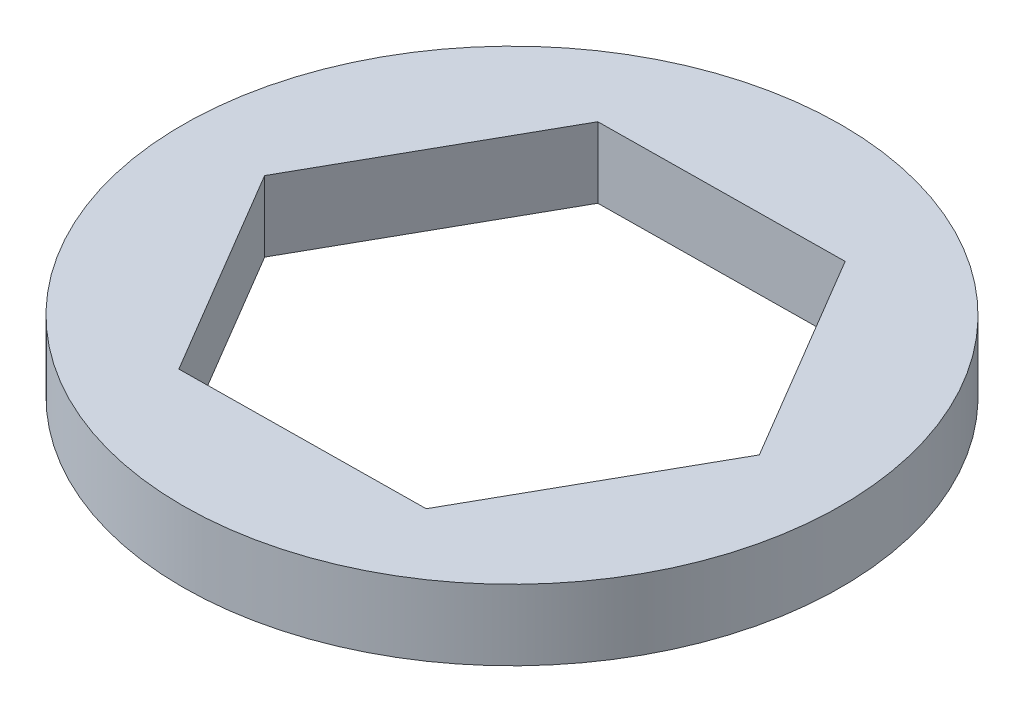
ISO-10303-21;
HEADER;
FILE_DESCRIPTION(('STEP AP214'),'2;1');
FILE_NAME('part.step','',(''),(''),'','','');
FILE_SCHEMA(('AUTOMOTIVE_DESIGN { 1 0 10303 214 1 1 1 1 }'));
ENDSEC;
DATA;
#1=APPLICATION_CONTEXT('core data for automotive mechanical design processes');
#2=APPLICATION_PROTOCOL_DEFINITION('international standard','automotive_design',2000,#1);
#3=PRODUCT_CONTEXT('',#1,'mechanical');
#4=PRODUCT('Part','Part','',(#3));
#5=PRODUCT_RELATED_PRODUCT_CATEGORY('part','',(#4));
#6=PRODUCT_DEFINITION_FORMATION('','',#4);
#7=PRODUCT_DEFINITION_CONTEXT('part definition',#1,'design');
#8=PRODUCT_DEFINITION('design','',#6,#7);
#9=PRODUCT_DEFINITION_SHAPE('','',#8);
#10=(LENGTH_UNIT() NAMED_UNIT(*) SI_UNIT(.MILLI.,.METRE.));
#11=(NAMED_UNIT(*) PLANE_ANGLE_UNIT() SI_UNIT($,.RADIAN.));
#12=(NAMED_UNIT(*) SI_UNIT($,.STERADIAN.) SOLID_ANGLE_UNIT());
#13=UNCERTAINTY_MEASURE_WITH_UNIT(LENGTH_MEASURE(1.E-05),#10,'distance_accuracy_value','');
#14=(GEOMETRIC_REPRESENTATION_CONTEXT(3) GLOBAL_UNCERTAINTY_ASSIGNED_CONTEXT((#13)) GLOBAL_UNIT_ASSIGNED_CONTEXT((#10,
#11,#12)) REPRESENTATION_CONTEXT('',''));
#15=CARTESIAN_POINT('',(0.,0.,0.));
#16=DIRECTION('',(0.,0.,1.));
#17=DIRECTION('',(1.,0.,0.));
#18=AXIS2_PLACEMENT_3D('',#15,#16,#17);
#19=CARTESIAN_POINT('',(0.,1.905,0.));
#20=DIRECTION('',(0.,1.,0.));
#21=DIRECTION('',(0.,0.,1.));
#22=AXIS2_PLACEMENT_3D('',#19,#20,#21);
#23=PLANE('',#22);
#24=CARTESIAN_POINT('',(0.,1.905,0.));
#25=DIRECTION('',(0.,1.,0.));
#26=DIRECTION('',(0.,0.,1.));
#27=AXIS2_PLACEMENT_3D('',#24,#25,#26);
#28=CIRCLE('',#27,8.89);
#29=CARTESIAN_POINT('',(0.,1.905,8.89));
#30=VERTEX_POINT('',#29);
#31=EDGE_CURVE('E11',#30,#30,#28,.T.);
#32=ORIENTED_EDGE('',*,*,#31,.T.);
#33=EDGE_LOOP('',(#32));
#34=FACE_BOUND('',#33,.T.);
#35=DIRECTION('',(0.999937176283206,0.,-0.0112090805496368));
#36=VECTOR('',#35,1.);
#37=CARTESIAN_POINT('',(-3.23528960265632,1.905,5.75162596027801));
#38=LINE('',#37,#36);
#39=CARTESIAN_POINT('',(-3.23528960265632,1.905,5.75162596027801));
#40=VERTEX_POINT('',#39);
#41=CARTESIAN_POINT('',(3.36340939333866,1.905,5.67765596463904));
#42=VERTEX_POINT('',#41);
#43=EDGE_CURVE('E102',#40,#42,#38,.T.);
#44=ORIENTED_EDGE('',*,*,#43,.F.);
#45=DIRECTION('',(0.509675936650655,0.,0.860366456574917));
#46=VECTOR('',#45,1.);
#47=CARTESIAN_POINT('',(-6.59869899599498,1.905,0.0739699956389726));
#48=LINE('',#47,#46);
#49=CARTESIAN_POINT('',(-6.59869899599498,1.905,0.0739699956389726));
#50=VERTEX_POINT('',#49);
#51=EDGE_CURVE('E94',#50,#40,#48,.T.);
#52=ORIENTED_EDGE('',*,*,#51,.F.);
#53=DIRECTION('',(-0.490261239632551,0.,0.871575537124553));
#54=VECTOR('',#53,1.);
#55=CARTESIAN_POINT('',(-3.36340939333867,1.905,-5.67765596463904));
#56=LINE('',#55,#54);
#57=CARTESIAN_POINT('',(-3.36340939333867,1.905,-5.67765596463904));
#58=VERTEX_POINT('',#57);
#59=EDGE_CURVE('E122',#58,#50,#56,.T.);
#60=ORIENTED_EDGE('',*,*,#59,.F.);
#61=DIRECTION('',(-0.999937176283206,0.,0.0112090805496368));
#62=VECTOR('',#61,1.);
#63=CARTESIAN_POINT('',(3.23528960265631,1.905,-5.75162596027801));
#64=LINE('',#63,#62);
#65=CARTESIAN_POINT('',(3.23528960265631,1.905,-5.75162596027801));
#66=VERTEX_POINT('',#65);
#67=EDGE_CURVE('E120',#66,#58,#64,.T.);
#68=ORIENTED_EDGE('',*,*,#67,.F.);
#69=DIRECTION('',(-0.509675936650655,0.,-0.860366456574917));
#70=VECTOR('',#69,1.);
#71=CARTESIAN_POINT('',(6.59869899599498,1.905,-0.0739699956389742));
#72=LINE('',#71,#70);
#73=CARTESIAN_POINT('',(6.59869899599498,1.905,-0.0739699956389742));
#74=VERTEX_POINT('',#73);
#75=EDGE_CURVE('E116',#74,#66,#72,.T.);
#76=ORIENTED_EDGE('',*,*,#75,.F.);
#77=DIRECTION('',(0.490261239632551,0.,-0.871575537124554));
#78=VECTOR('',#77,1.);
#79=CARTESIAN_POINT('',(3.36340939333866,1.905,5.67765596463904));
#80=LINE('',#79,#78);
#81=EDGE_CURVE('E114',#42,#74,#80,.T.);
#82=ORIENTED_EDGE('',*,*,#81,.F.);
#83=EDGE_LOOP('',(#44,#52,#60,#68,#76,#82));
#84=FACE_BOUND('',#83,.T.);
#85=ADVANCED_FACE('F41',(#34,#84),#23,.T.);
#86=CARTESIAN_POINT('',(0.,0.,0.));
#87=DIRECTION('',(0.,1.,0.));
#88=DIRECTION('',(0.,0.,1.));
#89=AXIS2_PLACEMENT_3D('',#86,#87,#88);
#90=PLANE('',#89);
#91=CARTESIAN_POINT('',(0.,0.,0.));
#92=DIRECTION('',(0.,1.,0.));
#93=DIRECTION('',(0.,0.,1.));
#94=AXIS2_PLACEMENT_3D('',#91,#92,#93);
#95=CIRCLE('',#94,8.89);
#96=CARTESIAN_POINT('',(0.,0.,8.89));
#97=VERTEX_POINT('',#96);
#98=EDGE_CURVE('E45',#97,#97,#95,.T.);
#99=ORIENTED_EDGE('',*,*,#98,.F.);
#100=EDGE_LOOP('',(#99));
#101=FACE_BOUND('',#100,.T.);
#102=DIRECTION('',(0.509675936650655,0.,0.860366456574917));
#103=VECTOR('',#102,1.);
#104=CARTESIAN_POINT('',(-6.59869899599498,0.,0.0739699956389726));
#105=LINE('',#104,#103);
#106=CARTESIAN_POINT('',(-6.59869899599498,0.,0.0739699956389724));
#107=VERTEX_POINT('',#106);
#108=CARTESIAN_POINT('',(-3.23528960265632,0.,5.75162596027801));
#109=VERTEX_POINT('',#108);
#110=EDGE_CURVE('E64',#107,#109,#105,.T.);
#111=ORIENTED_EDGE('',*,*,#110,.T.);
#112=DIRECTION('',(0.999937176283206,0.,-0.0112090805496368));
#113=VECTOR('',#112,1.);
#114=CARTESIAN_POINT('',(-3.23528960265632,0.,5.75162596027801));
#115=LINE('',#114,#113);
#116=CARTESIAN_POINT('',(3.36340939333866,0.,5.67765596463904));
#117=VERTEX_POINT('',#116);
#118=EDGE_CURVE('E109',#109,#117,#115,.T.);
#119=ORIENTED_EDGE('',*,*,#118,.T.);
#120=DIRECTION('',(0.490261239632551,0.,-0.871575537124554));
#121=VECTOR('',#120,1.);
#122=CARTESIAN_POINT('',(3.36340939333866,0.,5.67765596463904));
#123=LINE('',#122,#121);
#124=CARTESIAN_POINT('',(6.59869899599498,0.,-0.0739699956389742));
#125=VERTEX_POINT('',#124);
#126=EDGE_CURVE('E126',#117,#125,#123,.T.);
#127=ORIENTED_EDGE('',*,*,#126,.T.);
#128=DIRECTION('',(-0.509675936650655,0.,-0.860366456574917));
#129=VECTOR('',#128,1.);
#130=CARTESIAN_POINT('',(6.59869899599498,0.,-0.0739699956389742));
#131=LINE('',#130,#129);
#132=CARTESIAN_POINT('',(3.23528960265631,0.,-5.75162596027801));
#133=VERTEX_POINT('',#132);
#134=EDGE_CURVE('E129',#125,#133,#131,.T.);
#135=ORIENTED_EDGE('',*,*,#134,.T.);
#136=DIRECTION('',(-0.999937176283206,0.,0.0112090805496368));
#137=VECTOR('',#136,1.);
#138=CARTESIAN_POINT('',(3.23528960265631,0.,-5.75162596027801));
#139=LINE('',#138,#137);
#140=CARTESIAN_POINT('',(-3.36340939333867,0.,-5.67765596463904));
#141=VERTEX_POINT('',#140);
#142=EDGE_CURVE('E132',#133,#141,#139,.T.);
#143=ORIENTED_EDGE('',*,*,#142,.T.);
#144=DIRECTION('',(-0.490261239632551,0.,0.871575537124553));
#145=VECTOR('',#144,1.);
#146=CARTESIAN_POINT('',(-3.36340939333867,0.,-5.67765596463904));
#147=LINE('',#146,#145);
#148=EDGE_CURVE('E103',#141,#107,#147,.T.);
#149=ORIENTED_EDGE('',*,*,#148,.T.);
#150=EDGE_LOOP('',(#111,#119,#127,#135,#143,#149));
#151=FACE_BOUND('',#150,.T.);
#152=ADVANCED_FACE('F149',(#101,#151),#90,.F.);
#153=CARTESIAN_POINT('',(0.,1.905,0.));
#154=DIRECTION('',(0.,-1.,0.));
#155=DIRECTION('',(0.,0.,-1.));
#156=AXIS2_PLACEMENT_3D('',#153,#154,#155);
#157=CYLINDRICAL_SURFACE('',#156,8.89);
#158=ORIENTED_EDGE('',*,*,#31,.F.);
#159=EDGE_LOOP('',(#158));
#160=FACE_BOUND('',#159,.T.);
#161=ORIENTED_EDGE('',*,*,#98,.T.);
#162=EDGE_LOOP('',(#161));
#163=FACE_BOUND('',#162,.T.);
#164=ADVANCED_FACE('F43',(#160,#163),#157,.T.);
#165=CARTESIAN_POINT('',(-6.59869899599498,1.905,0.0739699956389726));
#166=DIRECTION('',(0.860366456574917,0.,-0.509675936650655));
#167=DIRECTION('',(-0.509675936650655,0.,-0.860366456574917));
#168=AXIS2_PLACEMENT_3D('',#165,#166,#167);
#169=PLANE('',#168);
#170=ORIENTED_EDGE('',*,*,#110,.F.);
#171=DIRECTION('',(0.,-1.,0.));
#172=VECTOR('',#171,1.);
#173=CARTESIAN_POINT('',(-6.59869899599498,1.905,0.0739699956389726));
#174=LINE('',#173,#172);
#175=EDGE_CURVE('E98',#50,#107,#174,.T.);
#176=ORIENTED_EDGE('',*,*,#175,.F.);
#177=ORIENTED_EDGE('',*,*,#51,.T.);
#178=DIRECTION('',(0.,-1.,0.));
#179=VECTOR('',#178,1.);
#180=CARTESIAN_POINT('',(-3.23528960265632,1.905,5.75162596027801));
#181=LINE('',#180,#179);
#182=EDGE_CURVE('E97',#40,#109,#181,.T.);
#183=ORIENTED_EDGE('',*,*,#182,.T.);
#184=EDGE_LOOP('',(#170,#176,#177,#183));
#185=FACE_BOUND('',#184,.T.);
#186=ADVANCED_FACE('F96',(#185),#169,.T.);
#187=CARTESIAN_POINT('',(-3.23528960265632,1.905,5.75162596027801));
#188=DIRECTION('',(-0.0112090805496368,0.,-0.999937176283206));
#189=DIRECTION('',(-0.999937176283206,0.,0.0112090805496368));
#190=AXIS2_PLACEMENT_3D('',#187,#188,#189);
#191=PLANE('',#190);
#192=ORIENTED_EDGE('',*,*,#118,.F.);
#193=ORIENTED_EDGE('',*,*,#182,.F.);
#194=ORIENTED_EDGE('',*,*,#43,.T.);
#195=DIRECTION('',(0.,-1.,0.));
#196=VECTOR('',#195,1.);
#197=CARTESIAN_POINT('',(3.36340939333866,1.905,5.67765596463904));
#198=LINE('',#197,#196);
#199=EDGE_CURVE('E110',#42,#117,#198,.T.);
#200=ORIENTED_EDGE('',*,*,#199,.T.);
#201=EDGE_LOOP('',(#192,#193,#194,#200));
#202=FACE_BOUND('',#201,.T.);
#203=ADVANCED_FACE('F106',(#202),#191,.T.);
#204=CARTESIAN_POINT('',(3.36340939333866,1.905,5.67765596463904));
#205=DIRECTION('',(-0.871575537124553,0.,-0.490261239632551));
#206=DIRECTION('',(-0.490261239632551,0.,0.871575537124554));
#207=AXIS2_PLACEMENT_3D('',#204,#205,#206);
#208=PLANE('',#207);
#209=ORIENTED_EDGE('',*,*,#126,.F.);
#210=ORIENTED_EDGE('',*,*,#199,.F.);
#211=ORIENTED_EDGE('',*,*,#81,.T.);
#212=DIRECTION('',(0.,-1.,0.));
#213=VECTOR('',#212,1.);
#214=CARTESIAN_POINT('',(6.59869899599498,1.905,-0.0739699956389742));
#215=LINE('',#214,#213);
#216=EDGE_CURVE('E141',#74,#125,#215,.T.);
#217=ORIENTED_EDGE('',*,*,#216,.T.);
#218=EDGE_LOOP('',(#209,#210,#211,#217));
#219=FACE_BOUND('',#218,.T.);
#220=ADVANCED_FACE('F145',(#219),#208,.T.);
#221=CARTESIAN_POINT('',(6.59869899599498,1.905,-0.0739699956389742));
#222=DIRECTION('',(-0.860366456574917,0.,0.509675936650655));
#223=DIRECTION('',(0.509675936650655,0.,0.860366456574917));
#224=AXIS2_PLACEMENT_3D('',#221,#222,#223);
#225=PLANE('',#224);
#226=ORIENTED_EDGE('',*,*,#134,.F.);
#227=ORIENTED_EDGE('',*,*,#216,.F.);
#228=ORIENTED_EDGE('',*,*,#75,.T.);
#229=DIRECTION('',(0.,-1.,0.));
#230=VECTOR('',#229,1.);
#231=CARTESIAN_POINT('',(3.23528960265631,1.905,-5.75162596027801));
#232=LINE('',#231,#230);
#233=EDGE_CURVE('E139',#66,#133,#232,.T.);
#234=ORIENTED_EDGE('',*,*,#233,.T.);
#235=EDGE_LOOP('',(#226,#227,#228,#234));
#236=FACE_BOUND('',#235,.T.);
#237=ADVANCED_FACE('F157',(#236),#225,.T.);
#238=CARTESIAN_POINT('',(3.23528960265631,1.905,-5.75162596027801));
#239=DIRECTION('',(0.0112090805496368,0.,0.999937176283206));
#240=DIRECTION('',(0.999937176283206,0.,-0.0112090805496368));
#241=AXIS2_PLACEMENT_3D('',#238,#239,#240);
#242=PLANE('',#241);
#243=ORIENTED_EDGE('',*,*,#142,.F.);
#244=ORIENTED_EDGE('',*,*,#233,.F.);
#245=ORIENTED_EDGE('',*,*,#67,.T.);
#246=DIRECTION('',(0.,-1.,0.));
#247=VECTOR('',#246,1.);
#248=CARTESIAN_POINT('',(-3.36340939333867,1.905,-5.67765596463904));
#249=LINE('',#248,#247);
#250=EDGE_CURVE('E56',#58,#141,#249,.T.);
#251=ORIENTED_EDGE('',*,*,#250,.T.);
#252=EDGE_LOOP('',(#243,#244,#245,#251));
#253=FACE_BOUND('',#252,.T.);
#254=ADVANCED_FACE('F155',(#253),#242,.T.);
#255=CARTESIAN_POINT('',(-3.36340939333867,1.905,-5.67765596463904));
#256=DIRECTION('',(0.871575537124554,0.,0.490261239632552));
#257=DIRECTION('',(0.490261239632552,0.,-0.871575537124554));
#258=AXIS2_PLACEMENT_3D('',#255,#256,#257);
#259=PLANE('',#258);
#260=ORIENTED_EDGE('',*,*,#148,.F.);
#261=ORIENTED_EDGE('',*,*,#250,.F.);
#262=ORIENTED_EDGE('',*,*,#59,.T.);
#263=ORIENTED_EDGE('',*,*,#175,.T.);
#264=EDGE_LOOP('',(#260,#261,#262,#263));
#265=FACE_BOUND('',#264,.T.);
#266=ADVANCED_FACE('F151',(#265),#259,.T.);
#267=CLOSED_SHELL('',(#85,#152,#164,#186,#203,#220,#237,#254,#266));
#268=MANIFOLD_SOLID_BREP('B2',#267);
#269=ADVANCED_BREP_SHAPE_REPRESENTATION('',(#18,#268),#14);
#270=SHAPE_DEFINITION_REPRESENTATION(#9,#269);
ENDSEC;
END-ISO-10303-21;
